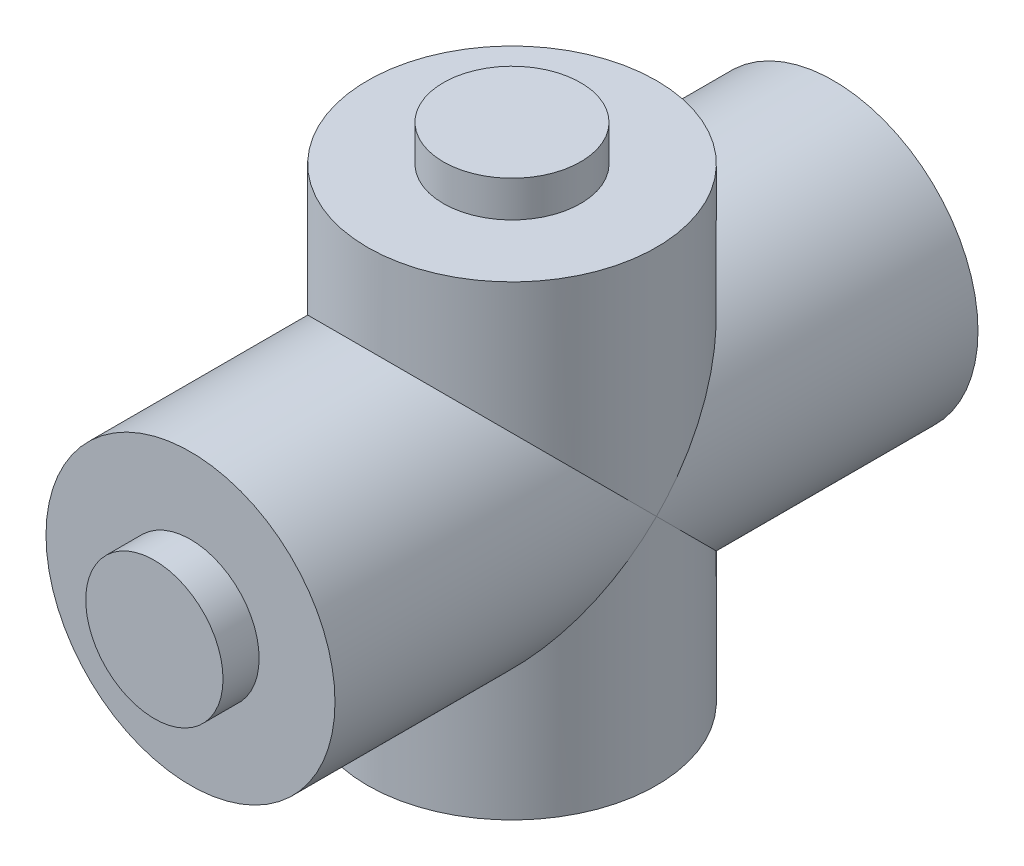
ISO-10303-21;
HEADER;
FILE_DESCRIPTION(('STEP AP214'),'2;1');
FILE_NAME('part.step','',(''),(''),'','','');
FILE_SCHEMA(('AUTOMOTIVE_DESIGN { 1 0 10303 214 1 1 1 1 }'));
ENDSEC;
DATA;
#1=APPLICATION_CONTEXT('core data for automotive mechanical design processes');
#2=APPLICATION_PROTOCOL_DEFINITION('international standard','automotive_design',2000,#1);
#3=PRODUCT_CONTEXT('',#1,'mechanical');
#4=PRODUCT('Part','Part','',(#3));
#5=PRODUCT_RELATED_PRODUCT_CATEGORY('part','',(#4));
#6=PRODUCT_DEFINITION_FORMATION('','',#4);
#7=PRODUCT_DEFINITION_CONTEXT('part definition',#1,'design');
#8=PRODUCT_DEFINITION('design','',#6,#7);
#9=PRODUCT_DEFINITION_SHAPE('','',#8);
#10=(LENGTH_UNIT() NAMED_UNIT(*) SI_UNIT(.MILLI.,.METRE.));
#11=(NAMED_UNIT(*) PLANE_ANGLE_UNIT() SI_UNIT($,.RADIAN.));
#12=(NAMED_UNIT(*) SI_UNIT($,.STERADIAN.) SOLID_ANGLE_UNIT());
#13=UNCERTAINTY_MEASURE_WITH_UNIT(LENGTH_MEASURE(1.E-05),#10,'distance_accuracy_value','');
#14=(GEOMETRIC_REPRESENTATION_CONTEXT(3) GLOBAL_UNCERTAINTY_ASSIGNED_CONTEXT((#13)) GLOBAL_UNIT_ASSIGNED_CONTEXT((#10,
#11,#12)) REPRESENTATION_CONTEXT('',''));
#15=CARTESIAN_POINT('',(0.,0.,0.));
#16=DIRECTION('',(0.,0.,1.));
#17=DIRECTION('',(1.,0.,0.));
#18=AXIS2_PLACEMENT_3D('',#15,#16,#17);
#19=CARTESIAN_POINT('',(0.,0.,17.8));
#20=DIRECTION('',(0.,0.,-1.));
#21=DIRECTION('',(-1.,0.,0.));
#22=AXIS2_PLACEMENT_3D('',#19,#20,#21);
#23=CYLINDRICAL_SURFACE('',#22,4.);
#24=CARTESIAN_POINT('',(0.,0.,8.9));
#25=DIRECTION('',(0.,-0.707106781186547,-0.707106781186548));
#26=DIRECTION('',(0.,0.707106781186547,-0.707106781186548));
#27=AXIS2_PLACEMENT_3D('',#24,#25,#26);
#28=ELLIPSE('',#27,5.65685424949238,4.);
#29=CARTESIAN_POINT('',(-4.,0.,8.9));
#30=VERTEX_POINT('',#29);
#31=CARTESIAN_POINT('',(4.,0.,8.9));
#32=VERTEX_POINT('',#31);
#33=EDGE_CURVE('E61',#30,#32,#28,.T.);
#34=ORIENTED_EDGE('',*,*,#33,.T.);
#35=CARTESIAN_POINT('',(0.,0.,8.9));
#36=DIRECTION('',(0.,0.707106781186547,-0.707106781186548));
#37=DIRECTION('',(0.,-0.707106781186547,-0.707106781186548));
#38=AXIS2_PLACEMENT_3D('',#35,#36,#37);
#39=ELLIPSE('',#38,5.65685424949238,4.);
#40=EDGE_CURVE('E66',#32,#30,#39,.T.);
#41=ORIENTED_EDGE('',*,*,#40,.T.);
#42=EDGE_LOOP('',(#34,#41));
#43=FACE_BOUND('',#42,.T.);
#44=CARTESIAN_POINT('',(0.,0.,0.));
#45=DIRECTION('',(0.,0.,1.));
#46=DIRECTION('',(1.,0.,0.));
#47=AXIS2_PLACEMENT_3D('',#44,#45,#46);
#48=CIRCLE('',#47,4.);
#49=CARTESIAN_POINT('',(4.,0.,0.));
#50=VERTEX_POINT('',#49);
#51=EDGE_CURVE('E78',#50,#50,#48,.T.);
#52=ORIENTED_EDGE('',*,*,#51,.T.);
#53=EDGE_LOOP('',(#52));
#54=FACE_BOUND('',#53,.T.);
#55=ADVANCED_FACE('F39',(#43,#54),#23,.T.);
#56=CARTESIAN_POINT('',(0.,0.,0.));
#57=DIRECTION('',(0.,0.,1.));
#58=DIRECTION('',(1.,0.,0.));
#59=AXIS2_PLACEMENT_3D('',#56,#57,#58);
#60=PLANE('',#59);
#61=CARTESIAN_POINT('',(0.,0.,0.));
#62=DIRECTION('',(0.,0.,-1.));
#63=DIRECTION('',(-1.,0.,0.));
#64=AXIS2_PLACEMENT_3D('',#61,#62,#63);
#65=CIRCLE('',#64,1.9);
#66=CARTESIAN_POINT('',(-1.9,0.,0.));
#67=VERTEX_POINT('',#66);
#68=EDGE_CURVE('E71',#67,#67,#65,.T.);
#69=ORIENTED_EDGE('',*,*,#68,.F.);
#70=EDGE_LOOP('',(#69));
#71=FACE_BOUND('',#70,.T.);
#72=ORIENTED_EDGE('',*,*,#51,.F.);
#73=EDGE_LOOP('',(#72));
#74=FACE_BOUND('',#73,.T.);
#75=ADVANCED_FACE('F147',(#71,#74),#60,.F.);
#76=CARTESIAN_POINT('',(0.,0.,-1.));
#77=DIRECTION('',(0.,0.,1.));
#78=DIRECTION('',(1.,0.,0.));
#79=AXIS2_PLACEMENT_3D('',#76,#77,#78);
#80=CYLINDRICAL_SURFACE('',#79,1.9);
#81=CARTESIAN_POINT('',(0.,0.,-1.));
#82=DIRECTION('',(0.,0.,-1.));
#83=DIRECTION('',(-1.,0.,0.));
#84=AXIS2_PLACEMENT_3D('',#81,#82,#83);
#85=CIRCLE('',#84,1.9);
#86=CARTESIAN_POINT('',(-1.9,0.,-1.));
#87=VERTEX_POINT('',#86);
#88=EDGE_CURVE('E94',#87,#87,#85,.T.);
#89=ORIENTED_EDGE('',*,*,#88,.F.);
#90=EDGE_LOOP('',(#89));
#91=FACE_BOUND('',#90,.T.);
#92=ORIENTED_EDGE('',*,*,#68,.T.);
#93=EDGE_LOOP('',(#92));
#94=FACE_BOUND('',#93,.T.);
#95=ADVANCED_FACE('F151',(#91,#94),#80,.T.);
#96=CARTESIAN_POINT('',(0.,0.,-1.));
#97=DIRECTION('',(0.,0.,-1.));
#98=DIRECTION('',(-1.,0.,0.));
#99=AXIS2_PLACEMENT_3D('',#96,#97,#98);
#100=PLANE('',#99);
#101=ORIENTED_EDGE('',*,*,#88,.T.);
#102=EDGE_LOOP('',(#101));
#103=FACE_BOUND('',#102,.T.);
#104=ADVANCED_FACE('F179',(#103),#100,.T.);
#105=CARTESIAN_POINT('',(0.,-6.45,8.9));
#106=DIRECTION('',(0.,1.,0.));
#107=DIRECTION('',(0.,0.,1.));
#108=AXIS2_PLACEMENT_3D('',#105,#106,#107);
#109=PLANE('',#108);
#110=CARTESIAN_POINT('',(0.,-6.45,8.9));
#111=DIRECTION('',(0.,-1.,0.));
#112=DIRECTION('',(0.,0.,-1.));
#113=AXIS2_PLACEMENT_3D('',#110,#111,#112);
#114=CIRCLE('',#113,1.9);
#115=CARTESIAN_POINT('',(0.,-6.45,7.));
#116=VERTEX_POINT('',#115);
#117=EDGE_CURVE('E48',#116,#116,#114,.T.);
#118=ORIENTED_EDGE('',*,*,#117,.F.);
#119=EDGE_LOOP('',(#118));
#120=FACE_BOUND('',#119,.T.);
#121=CARTESIAN_POINT('',(0.,-6.45,8.9));
#122=DIRECTION('',(0.,1.,0.));
#123=DIRECTION('',(0.,0.,1.));
#124=AXIS2_PLACEMENT_3D('',#121,#122,#123);
#125=CIRCLE('',#124,4.);
#126=CARTESIAN_POINT('',(0.,-6.45,12.9));
#127=VERTEX_POINT('',#126);
#128=EDGE_CURVE('E101',#127,#127,#125,.T.);
#129=ORIENTED_EDGE('',*,*,#128,.F.);
#130=EDGE_LOOP('',(#129));
#131=FACE_BOUND('',#130,.T.);
#132=ADVANCED_FACE('F142',(#120,#131),#109,.F.);
#133=CARTESIAN_POINT('',(0.,-6.45,8.9));
#134=DIRECTION('',(0.,1.,0.));
#135=DIRECTION('',(0.,0.,1.));
#136=AXIS2_PLACEMENT_3D('',#133,#134,#135);
#137=CYLINDRICAL_SURFACE('',#136,4.);
#138=ORIENTED_EDGE('',*,*,#128,.T.);
#139=EDGE_LOOP('',(#138));
#140=FACE_BOUND('',#139,.T.);
#141=ORIENTED_EDGE('',*,*,#40,.F.);
#142=CARTESIAN_POINT('',(0.,0.,8.9));
#143=DIRECTION('',(0.,-0.707106781186547,-0.707106781186548));
#144=DIRECTION('',(0.,0.707106781186547,-0.707106781186548));
#145=AXIS2_PLACEMENT_3D('',#142,#143,#144);
#146=ELLIPSE('',#145,5.65685424949238,4.);
#147=EDGE_CURVE('E55',#30,#32,#146,.F.);
#148=ORIENTED_EDGE('',*,*,#147,.F.);
#149=EDGE_LOOP('',(#141,#148));
#150=FACE_BOUND('',#149,.T.);
#151=ADVANCED_FACE('F69',(#140,#150),#137,.T.);
#152=CARTESIAN_POINT('',(0.,6.45,8.9));
#153=DIRECTION('',(0.,1.,0.));
#154=DIRECTION('',(0.,0.,1.));
#155=AXIS2_PLACEMENT_3D('',#152,#153,#154);
#156=CIRCLE('',#155,4.);
#157=CARTESIAN_POINT('',(0.,6.45,12.9));
#158=VERTEX_POINT('',#157);
#159=EDGE_CURVE('E105',#158,#158,#156,.T.);
#160=ORIENTED_EDGE('',*,*,#159,.F.);
#161=EDGE_LOOP('',(#160));
#162=FACE_BOUND('',#161,.T.);
#163=CARTESIAN_POINT('',(0.,0.,8.9));
#164=DIRECTION('',(0.,0.707106781186547,-0.707106781186548));
#165=DIRECTION('',(0.,-0.707106781186547,-0.707106781186548));
#166=AXIS2_PLACEMENT_3D('',#163,#164,#165);
#167=ELLIPSE('',#166,5.65685424949238,4.);
#168=EDGE_CURVE('E42',#32,#30,#167,.F.);
#169=ORIENTED_EDGE('',*,*,#168,.F.);
#170=ORIENTED_EDGE('',*,*,#33,.F.);
#171=EDGE_LOOP('',(#169,#170));
#172=FACE_BOUND('',#171,.T.);
#173=ADVANCED_FACE('F62',(#162,#172),#137,.T.);
#174=CARTESIAN_POINT('',(0.,6.45,8.9));
#175=DIRECTION('',(0.,1.,0.));
#176=DIRECTION('',(0.,0.,1.));
#177=AXIS2_PLACEMENT_3D('',#174,#175,#176);
#178=PLANE('',#177);
#179=CARTESIAN_POINT('',(0.,6.45,8.9));
#180=DIRECTION('',(0.,1.,0.));
#181=DIRECTION('',(0.,0.,1.));
#182=AXIS2_PLACEMENT_3D('',#179,#180,#181);
#183=CIRCLE('',#182,1.9);
#184=CARTESIAN_POINT('',(0.,6.45,10.8));
#185=VERTEX_POINT('',#184);
#186=EDGE_CURVE('E11',#185,#185,#183,.T.);
#187=ORIENTED_EDGE('',*,*,#186,.F.);
#188=EDGE_LOOP('',(#187));
#189=FACE_BOUND('',#188,.T.);
#190=ORIENTED_EDGE('',*,*,#159,.T.);
#191=EDGE_LOOP('',(#190));
#192=FACE_BOUND('',#191,.T.);
#193=ADVANCED_FACE('F130',(#189,#192),#178,.T.);
#194=CARTESIAN_POINT('',(0.,0.,18.8));
#195=DIRECTION('',(0.,0.,1.));
#196=DIRECTION('',(1.,0.,0.));
#197=AXIS2_PLACEMENT_3D('',#194,#195,#196);
#198=PLANE('',#197);
#199=CARTESIAN_POINT('',(0.,0.,18.8));
#200=DIRECTION('',(0.,0.,1.));
#201=DIRECTION('',(1.,0.,0.));
#202=AXIS2_PLACEMENT_3D('',#199,#200,#201);
#203=CIRCLE('',#202,1.9);
#204=CARTESIAN_POINT('',(1.9,0.,18.8));
#205=VERTEX_POINT('',#204);
#206=EDGE_CURVE('E83',#205,#205,#203,.T.);
#207=ORIENTED_EDGE('',*,*,#206,.T.);
#208=EDGE_LOOP('',(#207));
#209=FACE_BOUND('',#208,.T.);
#210=ADVANCED_FACE('F133',(#209),#198,.T.);
#211=CARTESIAN_POINT('',(0.,0.,18.8));
#212=DIRECTION('',(0.,0.,-1.));
#213=DIRECTION('',(-1.,0.,0.));
#214=AXIS2_PLACEMENT_3D('',#211,#212,#213);
#215=CYLINDRICAL_SURFACE('',#214,1.9);
#216=ORIENTED_EDGE('',*,*,#206,.F.);
#217=EDGE_LOOP('',(#216));
#218=FACE_BOUND('',#217,.T.);
#219=CARTESIAN_POINT('',(0.,0.,17.8));
#220=DIRECTION('',(0.,0.,1.));
#221=DIRECTION('',(1.,0.,0.));
#222=AXIS2_PLACEMENT_3D('',#219,#220,#221);
#223=CIRCLE('',#222,1.9);
#224=CARTESIAN_POINT('',(1.9,0.,17.8));
#225=VERTEX_POINT('',#224);
#226=EDGE_CURVE('E87',#225,#225,#223,.T.);
#227=ORIENTED_EDGE('',*,*,#226,.T.);
#228=EDGE_LOOP('',(#227));
#229=FACE_BOUND('',#228,.T.);
#230=ADVANCED_FACE('F163',(#218,#229),#215,.T.);
#231=CARTESIAN_POINT('',(0.,0.,17.8));
#232=DIRECTION('',(0.,0.,1.));
#233=DIRECTION('',(1.,0.,0.));
#234=AXIS2_PLACEMENT_3D('',#231,#232,#233);
#235=PLANE('',#234);
#236=ORIENTED_EDGE('',*,*,#226,.F.);
#237=EDGE_LOOP('',(#236));
#238=FACE_BOUND('',#237,.T.);
#239=CARTESIAN_POINT('',(0.,0.,17.8));
#240=DIRECTION('',(0.,0.,1.));
#241=DIRECTION('',(1.,0.,0.));
#242=AXIS2_PLACEMENT_3D('',#239,#240,#241);
#243=CIRCLE('',#242,4.);
#244=CARTESIAN_POINT('',(4.,0.,17.8));
#245=VERTEX_POINT('',#244);
#246=EDGE_CURVE('E82',#245,#245,#243,.T.);
#247=ORIENTED_EDGE('',*,*,#246,.T.);
#248=EDGE_LOOP('',(#247));
#249=FACE_BOUND('',#248,.T.);
#250=ADVANCED_FACE('F155',(#238,#249),#235,.T.);
#251=ORIENTED_EDGE('',*,*,#246,.F.);
#252=EDGE_LOOP('',(#251));
#253=FACE_BOUND('',#252,.T.);
#254=ORIENTED_EDGE('',*,*,#147,.T.);
#255=ORIENTED_EDGE('',*,*,#168,.T.);
#256=EDGE_LOOP('',(#254,#255));
#257=FACE_BOUND('',#256,.T.);
#258=ADVANCED_FACE('F73',(#253,#257),#23,.T.);
#259=CARTESIAN_POINT('',(0.,-7.45,8.9));
#260=DIRECTION('',(0.,1.,0.));
#261=DIRECTION('',(0.,0.,1.));
#262=AXIS2_PLACEMENT_3D('',#259,#260,#261);
#263=CYLINDRICAL_SURFACE('',#262,1.9);
#264=CARTESIAN_POINT('',(0.,-7.45,8.9));
#265=DIRECTION('',(0.,-1.,0.));
#266=DIRECTION('',(0.,0.,-1.));
#267=AXIS2_PLACEMENT_3D('',#264,#265,#266);
#268=CIRCLE('',#267,1.9);
#269=CARTESIAN_POINT('',(0.,-7.45,7.));
#270=VERTEX_POINT('',#269);
#271=EDGE_CURVE('E109',#270,#270,#268,.T.);
#272=ORIENTED_EDGE('',*,*,#271,.F.);
#273=EDGE_LOOP('',(#272));
#274=FACE_BOUND('',#273,.T.);
#275=ORIENTED_EDGE('',*,*,#117,.T.);
#276=EDGE_LOOP('',(#275));
#277=FACE_BOUND('',#276,.T.);
#278=ADVANCED_FACE('F154',(#274,#277),#263,.T.);
#279=CARTESIAN_POINT('',(0.,-7.45,8.9));
#280=DIRECTION('',(0.,-1.,0.));
#281=DIRECTION('',(0.,0.,-1.));
#282=AXIS2_PLACEMENT_3D('',#279,#280,#281);
#283=PLANE('',#282);
#284=ORIENTED_EDGE('',*,*,#271,.T.);
#285=EDGE_LOOP('',(#284));
#286=FACE_BOUND('',#285,.T.);
#287=ADVANCED_FACE('F126',(#286),#283,.T.);
#288=CARTESIAN_POINT('',(0.,7.45,8.9));
#289=DIRECTION('',(0.,-1.,0.));
#290=DIRECTION('',(0.,0.,-1.));
#291=AXIS2_PLACEMENT_3D('',#288,#289,#290);
#292=CYLINDRICAL_SURFACE('',#291,1.9);
#293=CARTESIAN_POINT('',(0.,7.45,8.9));
#294=DIRECTION('',(0.,1.,0.));
#295=DIRECTION('',(0.,0.,1.));
#296=AXIS2_PLACEMENT_3D('',#293,#294,#295);
#297=CIRCLE('',#296,1.9);
#298=CARTESIAN_POINT('',(0.,7.45,10.8));
#299=VERTEX_POINT('',#298);
#300=EDGE_CURVE('E115',#299,#299,#297,.T.);
#301=ORIENTED_EDGE('',*,*,#300,.F.);
#302=EDGE_LOOP('',(#301));
#303=FACE_BOUND('',#302,.T.);
#304=ORIENTED_EDGE('',*,*,#186,.T.);
#305=EDGE_LOOP('',(#304));
#306=FACE_BOUND('',#305,.T.);
#307=ADVANCED_FACE('F123',(#303,#306),#292,.T.);
#308=CARTESIAN_POINT('',(0.,7.45,8.9));
#309=DIRECTION('',(0.,1.,0.));
#310=DIRECTION('',(0.,0.,1.));
#311=AXIS2_PLACEMENT_3D('',#308,#309,#310);
#312=PLANE('',#311);
#313=ORIENTED_EDGE('',*,*,#300,.T.);
#314=EDGE_LOOP('',(#313));
#315=FACE_BOUND('',#314,.T.);
#316=ADVANCED_FACE('F121',(#315),#312,.T.);
#317=CLOSED_SHELL('',(#55,#75,#95,#104,#132,#151,#173,#193,#210,#230,#250,#258,#278,#287,#307,#316));
#318=MANIFOLD_SOLID_BREP('B2',#317);
#319=ADVANCED_BREP_SHAPE_REPRESENTATION('',(#18,#318),#14);
#320=SHAPE_DEFINITION_REPRESENTATION(#9,#319);
ENDSEC;
END-ISO-10303-21;
